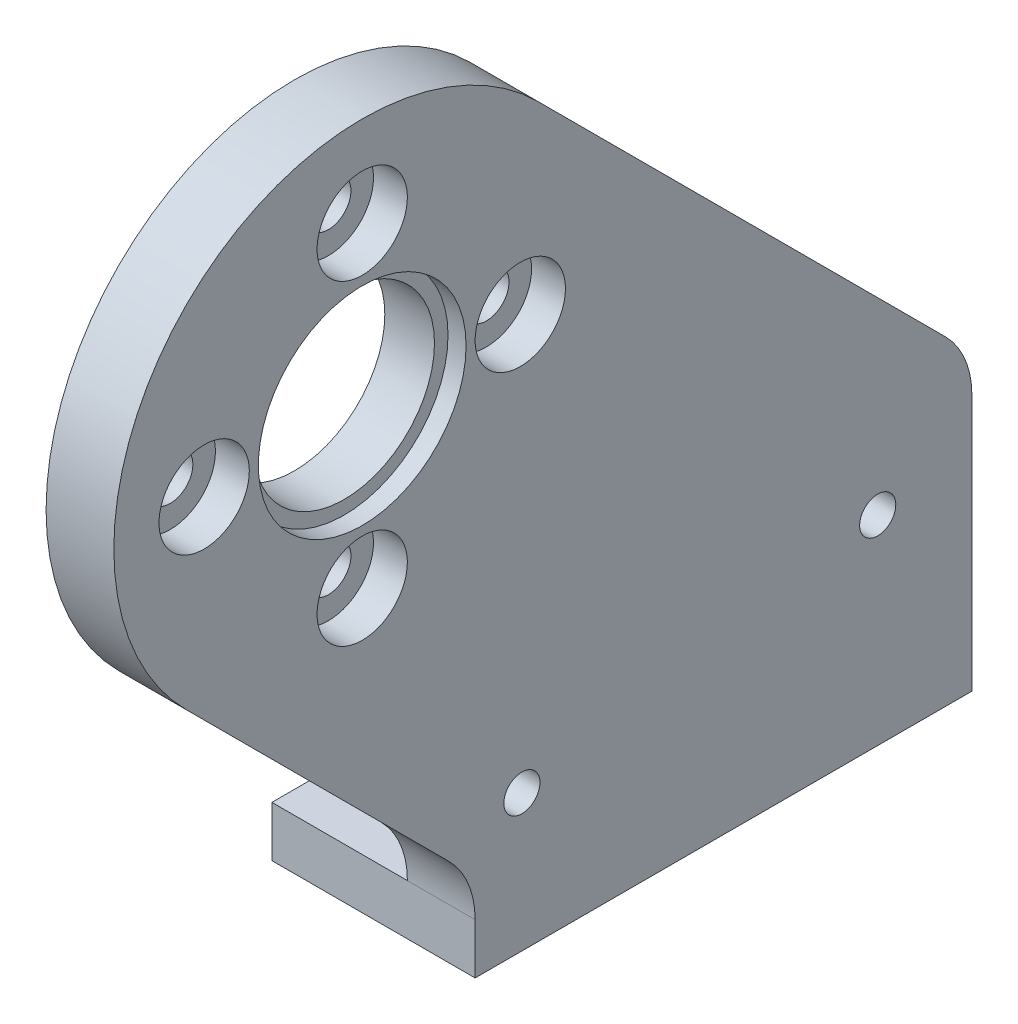
ISO-10303-21;
HEADER;
FILE_DESCRIPTION(('STEP AP214'),'2;1');
FILE_NAME('part.step','',(''),(''),'','','');
FILE_SCHEMA(('AUTOMOTIVE_DESIGN { 1 0 10303 214 1 1 1 1 }'));
ENDSEC;
DATA;
#1=APPLICATION_CONTEXT('core data for automotive mechanical design processes');
#2=APPLICATION_PROTOCOL_DEFINITION('international standard','automotive_design',2000,#1);
#3=PRODUCT_CONTEXT('',#1,'mechanical');
#4=PRODUCT('Part','Part','',(#3));
#5=PRODUCT_RELATED_PRODUCT_CATEGORY('part','',(#4));
#6=PRODUCT_DEFINITION_FORMATION('','',#4);
#7=PRODUCT_DEFINITION_CONTEXT('part definition',#1,'design');
#8=PRODUCT_DEFINITION('design','',#6,#7);
#9=PRODUCT_DEFINITION_SHAPE('','',#8);
#10=(LENGTH_UNIT() NAMED_UNIT(*) SI_UNIT(.MILLI.,.METRE.));
#11=(NAMED_UNIT(*) PLANE_ANGLE_UNIT() SI_UNIT($,.RADIAN.));
#12=(NAMED_UNIT(*) SI_UNIT($,.STERADIAN.) SOLID_ANGLE_UNIT());
#13=UNCERTAINTY_MEASURE_WITH_UNIT(LENGTH_MEASURE(1.E-05),#10,'distance_accuracy_value','');
#14=(GEOMETRIC_REPRESENTATION_CONTEXT(3) GLOBAL_UNCERTAINTY_ASSIGNED_CONTEXT((#13)) GLOBAL_UNIT_ASSIGNED_CONTEXT((#10,
#11,#12)) REPRESENTATION_CONTEXT('',''));
#15=CARTESIAN_POINT('',(0.,0.,0.));
#16=DIRECTION('',(0.,0.,1.));
#17=DIRECTION('',(1.,0.,0.));
#18=AXIS2_PLACEMENT_3D('',#15,#16,#17);
#19=CARTESIAN_POINT('',(69.5,-12.7999999999999,20.9999999999999));
#20=DIRECTION('',(-1.,0.,0.));
#21=DIRECTION('',(0.,0.,1.));
#22=AXIS2_PLACEMENT_3D('',#19,#20,#21);
#23=CYLINDRICAL_SURFACE('',#22,1.);
#24=CARTESIAN_POINT('',(60.,-12.7999999999999,20.9999999999999));
#25=DIRECTION('',(1.,0.,0.));
#26=DIRECTION('',(0.,0.,-1.));
#27=AXIS2_PLACEMENT_3D('',#24,#25,#26);
#28=CIRCLE('',#27,1.);
#29=CARTESIAN_POINT('',(60.,-12.7999999999999,19.9999999999999));
#30=VERTEX_POINT('',#29);
#31=EDGE_CURVE('E43',#30,#30,#28,.F.);
#32=ORIENTED_EDGE('',*,*,#31,.F.);
#33=EDGE_LOOP('',(#32));
#34=FACE_BOUND('',#33,.T.);
#35=CARTESIAN_POINT('',(58.5,-12.7999999999999,20.9999999999999));
#36=DIRECTION('',(-1.,0.,0.));
#37=DIRECTION('',(0.,0.,1.));
#38=AXIS2_PLACEMENT_3D('',#35,#36,#37);
#39=CIRCLE('',#38,1.);
#40=CARTESIAN_POINT('',(58.5,-12.7999999999999,21.9999999999999));
#41=VERTEX_POINT('',#40);
#42=EDGE_CURVE('E270',#41,#41,#39,.T.);
#43=ORIENTED_EDGE('',*,*,#42,.T.);
#44=EDGE_LOOP('',(#43));
#45=FACE_BOUND('',#44,.T.);
#46=ADVANCED_FACE('F39',(#34,#45),#23,.F.);
#47=CARTESIAN_POINT('',(69.5,-5.8,28.));
#48=DIRECTION('',(-1.,0.,0.));
#49=DIRECTION('',(0.,0.,1.));
#50=AXIS2_PLACEMENT_3D('',#47,#48,#49);
#51=CYLINDRICAL_SURFACE('',#50,1.);
#52=CARTESIAN_POINT('',(60.,-5.8,28.));
#53=DIRECTION('',(1.,0.,0.));
#54=DIRECTION('',(0.,0.,-1.));
#55=AXIS2_PLACEMENT_3D('',#52,#53,#54);
#56=CIRCLE('',#55,1.);
#57=CARTESIAN_POINT('',(60.,-5.8,27.));
#58=VERTEX_POINT('',#57);
#59=EDGE_CURVE('E255',#58,#58,#56,.F.);
#60=ORIENTED_EDGE('',*,*,#59,.F.);
#61=EDGE_LOOP('',(#60));
#62=FACE_BOUND('',#61,.T.);
#63=CARTESIAN_POINT('',(58.5,-5.8,28.));
#64=DIRECTION('',(-1.,0.,0.));
#65=DIRECTION('',(0.,0.,1.));
#66=AXIS2_PLACEMENT_3D('',#63,#64,#65);
#67=CIRCLE('',#66,1.);
#68=CARTESIAN_POINT('',(58.5,-5.8,29.));
#69=VERTEX_POINT('',#68);
#70=EDGE_CURVE('E272',#69,#69,#67,.T.);
#71=ORIENTED_EDGE('',*,*,#70,.T.);
#72=EDGE_LOOP('',(#71));
#73=FACE_BOUND('',#72,.T.);
#74=ADVANCED_FACE('F266',(#62,#73),#51,.F.);
#75=CARTESIAN_POINT('',(69.5,1.20000000000005,21.));
#76=DIRECTION('',(-1.,0.,0.));
#77=DIRECTION('',(0.,0.,1.));
#78=AXIS2_PLACEMENT_3D('',#75,#76,#77);
#79=CYLINDRICAL_SURFACE('',#78,1.);
#80=CARTESIAN_POINT('',(60.,1.20000000000005,21.));
#81=DIRECTION('',(1.,0.,0.));
#82=DIRECTION('',(0.,0.,-1.));
#83=AXIS2_PLACEMENT_3D('',#80,#81,#82);
#84=CIRCLE('',#83,1.);
#85=CARTESIAN_POINT('',(60.,1.20000000000005,20.));
#86=VERTEX_POINT('',#85);
#87=EDGE_CURVE('E155',#86,#86,#84,.F.);
#88=ORIENTED_EDGE('',*,*,#87,.F.);
#89=EDGE_LOOP('',(#88));
#90=FACE_BOUND('',#89,.T.);
#91=CARTESIAN_POINT('',(58.5,1.20000000000005,21.));
#92=DIRECTION('',(-1.,0.,0.));
#93=DIRECTION('',(0.,0.,1.));
#94=AXIS2_PLACEMENT_3D('',#91,#92,#93);
#95=CIRCLE('',#94,1.);
#96=CARTESIAN_POINT('',(58.5,1.20000000000005,22.));
#97=VERTEX_POINT('',#96);
#98=EDGE_CURVE('E276',#97,#97,#95,.T.);
#99=ORIENTED_EDGE('',*,*,#98,.T.);
#100=EDGE_LOOP('',(#99));
#101=FACE_BOUND('',#100,.T.);
#102=ADVANCED_FACE('F399',(#90,#101),#79,.F.);
#103=CARTESIAN_POINT('',(69.5,-5.79999999999995,14.));
#104=DIRECTION('',(-1.,0.,0.));
#105=DIRECTION('',(0.,0.,1.));
#106=AXIS2_PLACEMENT_3D('',#103,#104,#105);
#107=CYLINDRICAL_SURFACE('',#106,1.);
#108=CARTESIAN_POINT('',(60.,-5.79999999999995,14.));
#109=DIRECTION('',(1.,0.,0.));
#110=DIRECTION('',(0.,0.,-1.));
#111=AXIS2_PLACEMENT_3D('',#108,#109,#110);
#112=CIRCLE('',#111,1.);
#113=CARTESIAN_POINT('',(60.,-5.79999999999995,13.));
#114=VERTEX_POINT('',#113);
#115=EDGE_CURVE('E173',#114,#114,#112,.F.);
#116=ORIENTED_EDGE('',*,*,#115,.F.);
#117=EDGE_LOOP('',(#116));
#118=FACE_BOUND('',#117,.T.);
#119=CARTESIAN_POINT('',(58.5,-5.79999999999995,14.));
#120=DIRECTION('',(-1.,0.,0.));
#121=DIRECTION('',(0.,0.,1.));
#122=AXIS2_PLACEMENT_3D('',#119,#120,#121);
#123=CIRCLE('',#122,1.);
#124=CARTESIAN_POINT('',(58.5,-5.79999999999995,15.));
#125=VERTEX_POINT('',#124);
#126=EDGE_CURVE('E285',#125,#125,#123,.T.);
#127=ORIENTED_EDGE('',*,*,#126,.T.);
#128=EDGE_LOOP('',(#127));
#129=FACE_BOUND('',#128,.T.);
#130=ADVANCED_FACE('F402',(#118,#129),#107,.F.);
#131=CARTESIAN_POINT('',(60.5,-5.79999999999995,21.));
#132=DIRECTION('',(-1.,0.,0.));
#133=DIRECTION('',(0.,0.,-1.));
#134=AXIS2_PLACEMENT_3D('',#131,#132,#133);
#135=CYLINDRICAL_SURFACE('',#134,4.);
#136=CARTESIAN_POINT('',(60.7,-5.79999999999995,21.));
#137=DIRECTION('',(1.,0.,0.));
#138=DIRECTION('',(0.,0.,-1.));
#139=AXIS2_PLACEMENT_3D('',#136,#137,#138);
#140=CIRCLE('',#139,4.);
#141=CARTESIAN_POINT('',(60.7,-5.79999999999995,17.));
#142=VERTEX_POINT('',#141);
#143=EDGE_CURVE('E180',#142,#142,#140,.F.);
#144=ORIENTED_EDGE('',*,*,#143,.F.);
#145=EDGE_LOOP('',(#144));
#146=FACE_BOUND('',#145,.T.);
#147=CARTESIAN_POINT('',(58.5,-5.79999999999995,21.));
#148=DIRECTION('',(-1.,0.,0.));
#149=DIRECTION('',(0.,0.,1.));
#150=AXIS2_PLACEMENT_3D('',#147,#148,#149);
#151=CIRCLE('',#150,4.);
#152=CARTESIAN_POINT('',(58.5,-5.79999999999995,25.));
#153=VERTEX_POINT('',#152);
#154=EDGE_CURVE('E288',#153,#153,#151,.T.);
#155=ORIENTED_EDGE('',*,*,#154,.T.);
#156=EDGE_LOOP('',(#155));
#157=FACE_BOUND('',#156,.T.);
#158=ADVANCED_FACE('F409',(#146,#157),#135,.F.);
#159=CARTESIAN_POINT('',(61.61096680392,-28.0132034356,20.));
#160=DIRECTION('',(-1.,0.,0.));
#161=DIRECTION('',(0.,-0.707106781186548,0.707106781186548));
#162=AXIS2_PLACEMENT_3D('',#159,#160,#161);
#163=CYLINDRICAL_SURFACE('',#162,4.);
#164=DIRECTION('',(-1.,0.,0.));
#165=VECTOR('',#164,1.);
#166=CARTESIAN_POINT('',(61.5,-25.18477631085,17.171572875254));
#167=LINE('',#166,#165);
#168=CARTESIAN_POINT('',(61.5,-25.18477631085,17.171572875254));
#169=VERTEX_POINT('',#168);
#170=CARTESIAN_POINT('',(58.5,-25.1847763108514,17.1715728752554));
#171=VERTEX_POINT('',#170);
#172=EDGE_CURVE('E118',#169,#171,#167,.T.);
#173=ORIENTED_EDGE('',*,*,#172,.T.);
#174=CARTESIAN_POINT('',(58.5,-28.0132034356,20.));
#175=DIRECTION('',(1.,0.,0.));
#176=DIRECTION('',(0.,0.,1.));
#177=AXIS2_PLACEMENT_3D('',#174,#175,#176);
#178=CIRCLE('',#177,4.00000000000064);
#179=CARTESIAN_POINT('',(58.5,-28.0132034356,16.));
#180=VERTEX_POINT('',#179);
#181=EDGE_CURVE('E121',#180,#171,#178,.T.);
#182=ORIENTED_EDGE('',*,*,#181,.F.);
#183=DIRECTION('',(-1.,0.,0.));
#184=VECTOR('',#183,1.);
#185=CARTESIAN_POINT('',(61.54773426501,-28.0132034356,16.));
#186=LINE('',#185,#184);
#187=CARTESIAN_POINT('',(61.5,-28.0132034356,16.));
#188=VERTEX_POINT('',#187);
#189=EDGE_CURVE('E56',#188,#180,#186,.T.);
#190=ORIENTED_EDGE('',*,*,#189,.F.);
#191=CARTESIAN_POINT('',(61.5,-28.0132034356,20.));
#192=DIRECTION('',(-1.,0.,0.));
#193=DIRECTION('',(0.,0.707106781186548,-0.707106781186548));
#194=AXIS2_PLACEMENT_3D('',#191,#192,#193);
#195=CIRCLE('',#194,4.);
#196=EDGE_CURVE('E11',#169,#188,#195,.T.);
#197=ORIENTED_EDGE('',*,*,#196,.F.);
#198=EDGE_LOOP('',(#173,#182,#190,#197));
#199=FACE_BOUND('',#198,.T.);
#200=ADVANCED_FACE('F120',(#199),#163,.F.);
#201=CARTESIAN_POINT('',(60.93933982822,-28.86066017178,-6.));
#202=DIRECTION('',(0.,0.,-1.));
#203=DIRECTION('',(1.,0.,0.));
#204=AXIS2_PLACEMENT_3D('',#201,#202,#203);
#205=PLANE('',#204);
#206=DIRECTION('',(0.,-1.,2.95824592404915E-13));
#207=VECTOR('',#206,1.);
#208=CARTESIAN_POINT('',(58.5,-18.90050506339,-6.00000000000269));
#209=LINE('',#208,#207);
#210=CARTESIAN_POINT('',(58.5,-18.90050506339,-6.00000000000404));
#211=VERTEX_POINT('',#210);
#212=CARTESIAN_POINT('',(58.5,-28.0132034356,-6.));
#213=VERTEX_POINT('',#212);
#214=EDGE_CURVE('E291',#211,#213,#209,.T.);
#215=ORIENTED_EDGE('',*,*,#214,.F.);
#216=DIRECTION('',(1.,0.,0.));
#217=VECTOR('',#216,1.);
#218=CARTESIAN_POINT('',(59.5,-18.90050506339,-6.));
#219=LINE('',#218,#217);
#220=CARTESIAN_POINT('',(61.5,-18.90050506339,-6.));
#221=VERTEX_POINT('',#220);
#222=EDGE_CURVE('E126',#211,#221,#219,.T.);
#223=ORIENTED_EDGE('',*,*,#222,.T.);
#224=DIRECTION('',(0.,1.,0.));
#225=VECTOR('',#224,1.);
#226=CARTESIAN_POINT('',(61.5,-27.8,-6.));
#227=LINE('',#226,#225);
#228=CARTESIAN_POINT('',(61.5,-30.2494897427832,-6.));
#229=VERTEX_POINT('',#228);
#230=EDGE_CURVE('E48',#229,#221,#227,.T.);
#231=ORIENTED_EDGE('',*,*,#230,.F.);
#232=DIRECTION('',(-1.,0.,0.));
#233=VECTOR('',#232,1.);
#234=CARTESIAN_POINT('',(83.6415947150705,-30.2494897427832,-6.));
#235=LINE('',#234,#233);
#236=CARTESIAN_POINT('',(52.5,-30.2494897427832,-6.));
#237=VERTEX_POINT('',#236);
#238=EDGE_CURVE('E211',#229,#237,#235,.T.);
#239=ORIENTED_EDGE('',*,*,#238,.T.);
#240=DIRECTION('',(0.,-1.,0.));
#241=VECTOR('',#240,1.);
#242=CARTESIAN_POINT('',(52.5,-30.2494897427832,-6.));
#243=LINE('',#242,#241);
#244=CARTESIAN_POINT('',(52.5,-28.0132034356,-6.));
#245=VERTEX_POINT('',#244);
#246=EDGE_CURVE('E199',#245,#237,#243,.T.);
#247=ORIENTED_EDGE('',*,*,#246,.F.);
#248=DIRECTION('',(1.,0.,0.));
#249=VECTOR('',#248,1.);
#250=CARTESIAN_POINT('',(52.5,-28.0132034356,-6.));
#251=LINE('',#250,#249);
#252=EDGE_CURVE('E209',#245,#213,#251,.T.);
#253=ORIENTED_EDGE('',*,*,#252,.T.);
#254=EDGE_LOOP('',(#215,#223,#231,#239,#247,#253));
#255=FACE_BOUND('',#254,.T.);
#256=ADVANCED_FACE('F295',(#255),#205,.T.);
#257=CARTESIAN_POINT('',(60.93933982822,-28.86066017178,16.));
#258=DIRECTION('',(0.,0.,1.));
#259=DIRECTION('',(0.,1.,0.));
#260=AXIS2_PLACEMENT_3D('',#257,#258,#259);
#261=PLANE('',#260);
#262=ORIENTED_EDGE('',*,*,#189,.T.);
#263=DIRECTION('',(1.,0.,0.));
#264=VECTOR('',#263,1.);
#265=CARTESIAN_POINT('',(52.5,-28.0132034356,16.));
#266=LINE('',#265,#264);
#267=CARTESIAN_POINT('',(52.5,-28.0132034356,16.));
#268=VERTEX_POINT('',#267);
#269=EDGE_CURVE('E207',#268,#180,#266,.T.);
#270=ORIENTED_EDGE('',*,*,#269,.F.);
#271=DIRECTION('',(0.,1.,0.));
#272=VECTOR('',#271,1.);
#273=CARTESIAN_POINT('',(52.5,-28.0132034356,16.));
#274=LINE('',#273,#272);
#275=CARTESIAN_POINT('',(52.5,-30.2494897427832,16.));
#276=VERTEX_POINT('',#275);
#277=EDGE_CURVE('E205',#276,#268,#274,.T.);
#278=ORIENTED_EDGE('',*,*,#277,.F.);
#279=DIRECTION('',(-1.,0.,0.));
#280=VECTOR('',#279,1.);
#281=CARTESIAN_POINT('',(83.6415947150705,-30.2494897427832,16.));
#282=LINE('',#281,#280);
#283=CARTESIAN_POINT('',(61.5,-30.2494897427832,16.));
#284=VERTEX_POINT('',#283);
#285=EDGE_CURVE('E212',#284,#276,#282,.T.);
#286=ORIENTED_EDGE('',*,*,#285,.F.);
#287=DIRECTION('',(0.,1.,0.));
#288=VECTOR('',#287,1.);
#289=CARTESIAN_POINT('',(61.5,-28.86066017178,16.));
#290=LINE('',#289,#288);
#291=EDGE_CURVE('E214',#284,#188,#290,.T.);
#292=ORIENTED_EDGE('',*,*,#291,.T.);
#293=EDGE_LOOP('',(#262,#270,#278,#286,#292));
#294=FACE_BOUND('',#293,.T.);
#295=ADVANCED_FACE('F303',(#294),#261,.T.);
#296=CARTESIAN_POINT('',(61.5,-27.8,32.));
#297=DIRECTION('',(1.,0.,0.));
#298=DIRECTION('',(0.,-1.,0.));
#299=AXIS2_PLACEMENT_3D('',#296,#297,#298);
#300=PLANE('',#299);
#301=CARTESIAN_POINT('',(61.5,-12.7999999999999,20.9999999999999));
#302=DIRECTION('',(1.,0.,0.));
#303=DIRECTION('',(0.,0.,-1.));
#304=AXIS2_PLACEMENT_3D('',#301,#302,#303);
#305=CIRCLE('',#304,2.);
#306=CARTESIAN_POINT('',(61.5,-12.7999999999999,18.9999999999999));
#307=VERTEX_POINT('',#306);
#308=EDGE_CURVE('E156',#307,#307,#305,.T.);
#309=ORIENTED_EDGE('',*,*,#308,.F.);
#310=EDGE_LOOP('',(#309));
#311=FACE_BOUND('',#310,.T.);
#312=CARTESIAN_POINT('',(61.5,-5.8,28.));
#313=DIRECTION('',(1.,0.,0.));
#314=DIRECTION('',(0.,0.,-1.));
#315=AXIS2_PLACEMENT_3D('',#312,#313,#314);
#316=CIRCLE('',#315,2.);
#317=CARTESIAN_POINT('',(61.5,-5.8,26.));
#318=VERTEX_POINT('',#317);
#319=EDGE_CURVE('E162',#318,#318,#316,.T.);
#320=ORIENTED_EDGE('',*,*,#319,.F.);
#321=EDGE_LOOP('',(#320));
#322=FACE_BOUND('',#321,.T.);
#323=CARTESIAN_POINT('',(61.5,1.20000000000005,21.));
#324=DIRECTION('',(1.,0.,0.));
#325=DIRECTION('',(0.,0.,-1.));
#326=AXIS2_PLACEMENT_3D('',#323,#324,#325);
#327=CIRCLE('',#326,2.);
#328=CARTESIAN_POINT('',(61.5,1.20000000000005,19.));
#329=VERTEX_POINT('',#328);
#330=EDGE_CURVE('E151',#329,#329,#327,.T.);
#331=ORIENTED_EDGE('',*,*,#330,.F.);
#332=EDGE_LOOP('',(#331));
#333=FACE_BOUND('',#332,.T.);
#334=CARTESIAN_POINT('',(61.5,-5.79999999999995,14.));
#335=DIRECTION('',(1.,0.,0.));
#336=DIRECTION('',(0.,0.,-1.));
#337=AXIS2_PLACEMENT_3D('',#334,#335,#336);
#338=CIRCLE('',#337,2.);
#339=CARTESIAN_POINT('',(61.5,-5.79999999999995,12.));
#340=VERTEX_POINT('',#339);
#341=EDGE_CURVE('E174',#340,#340,#338,.T.);
#342=ORIENTED_EDGE('',*,*,#341,.F.);
#343=EDGE_LOOP('',(#342));
#344=FACE_BOUND('',#343,.T.);
#345=CARTESIAN_POINT('',(61.5,-5.80000000000003,21.0000000000001));
#346=DIRECTION('',(1.,0.,0.));
#347=DIRECTION('',(0.,0.,-1.));
#348=AXIS2_PLACEMENT_3D('',#345,#346,#347);
#349=CIRCLE('',#348,4.6);
#350=CARTESIAN_POINT('',(61.5,-5.80000000000003,16.4000000000001));
#351=VERTEX_POINT('',#350);
#352=EDGE_CURVE('E181',#351,#351,#349,.T.);
#353=ORIENTED_EDGE('',*,*,#352,.F.);
#354=EDGE_LOOP('',(#353));
#355=FACE_BOUND('',#354,.T.);
#356=ORIENTED_EDGE('',*,*,#196,.T.);
#357=ORIENTED_EDGE('',*,*,#291,.F.);
#358=DIRECTION('',(0.,0.,1.));
#359=VECTOR('',#358,1.);
#360=CARTESIAN_POINT('',(61.5,-30.2494897427832,32.));
#361=LINE('',#360,#359);
#362=EDGE_CURVE('E217',#229,#284,#361,.T.);
#363=ORIENTED_EDGE('',*,*,#362,.F.);
#364=ORIENTED_EDGE('',*,*,#230,.T.);
#365=CARTESIAN_POINT('',(61.5,-18.90050506339,-2.));
#366=DIRECTION('',(1.,0.,0.));
#367=DIRECTION('',(0.,0.,-1.));
#368=AXIS2_PLACEMENT_3D('',#365,#366,#367);
#369=CIRCLE('',#368,4.);
#370=CARTESIAN_POINT('',(61.5,-16.07207793864,-4.82842712475));
#371=VERTEX_POINT('',#370);
#372=EDGE_CURVE('E229',#221,#371,#369,.T.);
#373=ORIENTED_EDGE('',*,*,#372,.T.);
#374=DIRECTION('',(0.,-0.707106781186548,-0.707106781186548));
#375=VECTOR('',#374,1.);
#376=CARTESIAN_POINT('',(61.5,1.97817459305205,13.221825406948));
#377=LINE('',#376,#375);
#378=CARTESIAN_POINT('',(61.5,1.97817459305205,13.221825406948));
#379=VERTEX_POINT('',#378);
#380=EDGE_CURVE('E221',#379,#371,#377,.T.);
#381=ORIENTED_EDGE('',*,*,#380,.F.);
#382=CARTESIAN_POINT('',(61.5,-5.79999999999998,21.));
#383=DIRECTION('',(-1.,0.,0.));
#384=DIRECTION('',(0.,0.745298433795883,-0.666731013663985));
#385=AXIS2_PLACEMENT_3D('',#382,#383,#384);
#386=CIRCLE('',#385,11.);
#387=CARTESIAN_POINT('',(61.5,-13.578174593052,28.778174593052));
#388=VERTEX_POINT('',#387);
#389=EDGE_CURVE('E224',#388,#379,#386,.T.);
#390=ORIENTED_EDGE('',*,*,#389,.F.);
#391=DIRECTION('',(0.,0.707106781186548,0.707106781186548));
#392=VECTOR('',#391,1.);
#393=CARTESIAN_POINT('',(61.5,-25.18477631085,17.171572875254));
#394=LINE('',#393,#392);
#395=EDGE_CURVE('E125',#169,#388,#394,.T.);
#396=ORIENTED_EDGE('',*,*,#395,.F.);
#397=EDGE_LOOP('',(#356,#357,#363,#364,#373,#381,#390,#396));
#398=FACE_BOUND('',#397,.T.);
#399=CARTESIAN_POINT('',(61.5,-24.18477631085,13.928932188135));
#400=DIRECTION('',(-1.,0.,0.));
#401=DIRECTION('',(0.,-1.,0.));
#402=AXIS2_PLACEMENT_3D('',#399,#400,#401);
#403=CIRCLE('',#402,0.8);
#404=CARTESIAN_POINT('',(61.5,-24.98477631085,13.928932188135));
#405=VERTEX_POINT('',#404);
#406=EDGE_CURVE('E232',#405,#405,#403,.T.);
#407=ORIENTED_EDGE('',*,*,#406,.T.);
#408=EDGE_LOOP('',(#407));
#409=FACE_BOUND('',#408,.T.);
#410=CARTESIAN_POINT('',(61.5,-21.40640546818,-1.82799186006));
#411=DIRECTION('',(-1.,0.,0.));
#412=DIRECTION('',(0.,-1.,0.));
#413=AXIS2_PLACEMENT_3D('',#410,#411,#412);
#414=CIRCLE('',#413,0.8);
#415=CARTESIAN_POINT('',(61.5,-22.20640546818,-1.82799186006));
#416=VERTEX_POINT('',#415);
#417=EDGE_CURVE('E235',#416,#416,#414,.T.);
#418=ORIENTED_EDGE('',*,*,#417,.T.);
#419=EDGE_LOOP('',(#418));
#420=FACE_BOUND('',#419,.T.);
#421=ADVANCED_FACE('F305',(#311,#322,#333,#344,#355,#398,#409,#420),#300,.T.);
#422=CARTESIAN_POINT('',(59.40518465266,-18.90050506339,-2.));
#423=DIRECTION('',(1.,0.,0.));
#424=DIRECTION('',(0.,0.,1.));
#425=AXIS2_PLACEMENT_3D('',#422,#423,#424);
#426=CYLINDRICAL_SURFACE('',#425,4.);
#427=ORIENTED_EDGE('',*,*,#222,.F.);
#428=CARTESIAN_POINT('',(58.5,-18.90050506339,-2.));
#429=DIRECTION('',(-1.,0.,0.));
#430=DIRECTION('',(0.,0.,1.));
#431=AXIS2_PLACEMENT_3D('',#428,#429,#430);
#432=CIRCLE('',#431,4.00000000000404);
#433=CARTESIAN_POINT('',(58.5,-16.07207793864,-4.82842712475));
#434=VERTEX_POINT('',#433);
#435=EDGE_CURVE('E148',#434,#211,#432,.T.);
#436=ORIENTED_EDGE('',*,*,#435,.F.);
#437=DIRECTION('',(1.,0.,0.));
#438=VECTOR('',#437,1.);
#439=CARTESIAN_POINT('',(59.5,-16.07207793864,-4.82842712475));
#440=LINE('',#439,#438);
#441=EDGE_CURVE('E223',#434,#371,#440,.T.);
#442=ORIENTED_EDGE('',*,*,#441,.T.);
#443=ORIENTED_EDGE('',*,*,#372,.F.);
#444=EDGE_LOOP('',(#427,#436,#442,#443));
#445=FACE_BOUND('',#444,.T.);
#446=ADVANCED_FACE('F312',(#445),#426,.T.);
#447=CARTESIAN_POINT('',(60.5,-7.63273811042195,3.61091270347));
#448=DIRECTION('',(0.,-0.707106781186548,0.707106781186548));
#449=DIRECTION('',(0.,0.707106781186548,0.707106781186548));
#450=AXIS2_PLACEMENT_3D('',#447,#448,#449);
#451=PLANE('',#450);
#452=ORIENTED_EDGE('',*,*,#441,.F.);
#453=DIRECTION('',(0.,-0.707106781186431,-0.707106781186664));
#454=VECTOR('',#453,1.);
#455=CARTESIAN_POINT('',(58.5,1.97817459305204,13.221825406948));
#456=LINE('',#455,#454);
#457=CARTESIAN_POINT('',(58.5,1.97817459305204,13.221825406948));
#458=VERTEX_POINT('',#457);
#459=EDGE_CURVE('E142',#458,#434,#456,.T.);
#460=ORIENTED_EDGE('',*,*,#459,.F.);
#461=DIRECTION('',(-1.,0.,0.));
#462=VECTOR('',#461,1.);
#463=CARTESIAN_POINT('',(61.5,1.97817459305205,13.221825406948));
#464=LINE('',#463,#462);
#465=EDGE_CURVE('E226',#379,#458,#464,.T.);
#466=ORIENTED_EDGE('',*,*,#465,.F.);
#467=ORIENTED_EDGE('',*,*,#380,.T.);
#468=EDGE_LOOP('',(#452,#460,#466,#467));
#469=FACE_BOUND('',#468,.T.);
#470=ADVANCED_FACE('F436',(#469),#451,.F.);
#471=CARTESIAN_POINT('',(60.5,-5.79999999999998,21.));
#472=DIRECTION('',(-1.,0.,0.));
#473=DIRECTION('',(0.,0.,-1.));
#474=AXIS2_PLACEMENT_3D('',#471,#472,#473);
#475=CYLINDRICAL_SURFACE('',#474,11.);
#476=ORIENTED_EDGE('',*,*,#389,.T.);
#477=ORIENTED_EDGE('',*,*,#465,.T.);
#478=CARTESIAN_POINT('',(58.5,-5.79999999999998,21.));
#479=DIRECTION('',(-1.,0.,0.));
#480=DIRECTION('',(0.,0.,1.));
#481=AXIS2_PLACEMENT_3D('',#478,#479,#480);
#482=CIRCLE('',#481,11.);
#483=CARTESIAN_POINT('',(58.5,-13.578174593052,28.778174593052));
#484=VERTEX_POINT('',#483);
#485=EDGE_CURVE('E140',#484,#458,#482,.T.);
#486=ORIENTED_EDGE('',*,*,#485,.F.);
#487=DIRECTION('',(-1.,0.,0.));
#488=VECTOR('',#487,1.);
#489=CARTESIAN_POINT('',(61.5,-13.578174593052,28.778174593052));
#490=LINE('',#489,#488);
#491=EDGE_CURVE('E139',#388,#484,#490,.T.);
#492=ORIENTED_EDGE('',*,*,#491,.F.);
#493=EDGE_LOOP('',(#476,#477,#486,#492));
#494=FACE_BOUND('',#493,.T.);
#495=ADVANCED_FACE('F440',(#494),#475,.T.);
#496=CARTESIAN_POINT('',(60.5,-19.96726188958,22.389087296526));
#497=DIRECTION('',(0.,0.707106781186548,-0.707106781186548));
#498=DIRECTION('',(0.,-0.707106781186548,-0.707106781186548));
#499=AXIS2_PLACEMENT_3D('',#496,#497,#498);
#500=PLANE('',#499);
#501=ORIENTED_EDGE('',*,*,#491,.T.);
#502=DIRECTION('',(0.,0.707106781186603,0.707106781186492));
#503=VECTOR('',#502,1.);
#504=CARTESIAN_POINT('',(58.5,-25.1847763108509,17.1715728752549));
#505=LINE('',#504,#503);
#506=EDGE_CURVE('E134',#171,#484,#505,.T.);
#507=ORIENTED_EDGE('',*,*,#506,.F.);
#508=ORIENTED_EDGE('',*,*,#172,.F.);
#509=ORIENTED_EDGE('',*,*,#395,.T.);
#510=EDGE_LOOP('',(#501,#507,#508,#509));
#511=FACE_BOUND('',#510,.T.);
#512=ADVANCED_FACE('F137',(#511),#500,.F.);
#513=CARTESIAN_POINT('',(59.65,-24.18477631085,13.928932188135));
#514=DIRECTION('',(-1.,0.,0.));
#515=DIRECTION('',(0.,-1.,0.));
#516=AXIS2_PLACEMENT_3D('',#513,#514,#515);
#517=CONICAL_SURFACE('',#516,0.95,0.7853981625);
#518=CARTESIAN_POINT('',(59.5,-24.18477631085,13.928932188135));
#519=DIRECTION('',(-1.,0.,0.));
#520=DIRECTION('',(0.,0.,1.));
#521=AXIS2_PLACEMENT_3D('',#518,#519,#520);
#522=CIRCLE('',#521,1.1);
#523=CARTESIAN_POINT('',(59.5,-24.18477631085,15.028932188135));
#524=VERTEX_POINT('',#523);
#525=EDGE_CURVE('E279',#524,#524,#522,.T.);
#526=ORIENTED_EDGE('',*,*,#525,.T.);
#527=EDGE_LOOP('',(#526));
#528=FACE_BOUND('',#527,.T.);
#529=CARTESIAN_POINT('',(59.8,-24.18477631085,13.928932188135));
#530=DIRECTION('',(-1.,0.,0.));
#531=DIRECTION('',(0.,1.,0.));
#532=AXIS2_PLACEMENT_3D('',#529,#530,#531);
#533=CIRCLE('',#532,0.8);
#534=CARTESIAN_POINT('',(59.8,-23.38477631085,13.928932188135));
#535=VERTEX_POINT('',#534);
#536=EDGE_CURVE('E245',#535,#535,#533,.T.);
#537=ORIENTED_EDGE('',*,*,#536,.F.);
#538=EDGE_LOOP('',(#537));
#539=FACE_BOUND('',#538,.T.);
#540=ADVANCED_FACE('F319',(#528,#539),#517,.F.);
#541=CARTESIAN_POINT('',(62.10472291998,-24.18477631085,13.928932188135));
#542=DIRECTION('',(-1.,0.,0.));
#543=DIRECTION('',(0.,-1.,0.));
#544=AXIS2_PLACEMENT_3D('',#541,#542,#543);
#545=CYLINDRICAL_SURFACE('',#544,0.8);
#546=ORIENTED_EDGE('',*,*,#536,.T.);
#547=EDGE_LOOP('',(#546));
#548=FACE_BOUND('',#547,.T.);
#549=ORIENTED_EDGE('',*,*,#406,.F.);
#550=EDGE_LOOP('',(#549));
#551=FACE_BOUND('',#550,.T.);
#552=ADVANCED_FACE('F322',(#548,#551),#545,.F.);
#553=CARTESIAN_POINT('',(59.65,-21.40640546818,-1.82799186006));
#554=DIRECTION('',(-1.,0.,0.));
#555=DIRECTION('',(0.,-1.,0.));
#556=AXIS2_PLACEMENT_3D('',#553,#554,#555);
#557=CONICAL_SURFACE('',#556,0.95,0.7853981625);
#558=CARTESIAN_POINT('',(59.5,-21.40640546818,-1.82799186006));
#559=DIRECTION('',(-1.,0.,0.));
#560=DIRECTION('',(0.,0.,1.));
#561=AXIS2_PLACEMENT_3D('',#558,#559,#560);
#562=CIRCLE('',#561,1.1);
#563=CARTESIAN_POINT('',(59.5,-21.40640546818,-0.72799186006));
#564=VERTEX_POINT('',#563);
#565=EDGE_CURVE('E338',#564,#564,#562,.T.);
#566=ORIENTED_EDGE('',*,*,#565,.T.);
#567=EDGE_LOOP('',(#566));
#568=FACE_BOUND('',#567,.T.);
#569=CARTESIAN_POINT('',(59.8,-21.40640546818,-1.82799186006));
#570=DIRECTION('',(-1.,0.,0.));
#571=DIRECTION('',(0.,1.,0.));
#572=AXIS2_PLACEMENT_3D('',#569,#570,#571);
#573=CIRCLE('',#572,0.8);
#574=CARTESIAN_POINT('',(59.8,-20.60640546818,-1.82799186006));
#575=VERTEX_POINT('',#574);
#576=EDGE_CURVE('E220',#575,#575,#573,.T.);
#577=ORIENTED_EDGE('',*,*,#576,.F.);
#578=EDGE_LOOP('',(#577));
#579=FACE_BOUND('',#578,.T.);
#580=ADVANCED_FACE('F325',(#568,#579),#557,.F.);
#581=CARTESIAN_POINT('',(62.10472291998,-21.40640546818,-1.82799186006));
#582=DIRECTION('',(-1.,0.,0.));
#583=DIRECTION('',(0.,-1.,0.));
#584=AXIS2_PLACEMENT_3D('',#581,#582,#583);
#585=CYLINDRICAL_SURFACE('',#584,0.8);
#586=ORIENTED_EDGE('',*,*,#576,.T.);
#587=EDGE_LOOP('',(#586));
#588=FACE_BOUND('',#587,.T.);
#589=ORIENTED_EDGE('',*,*,#417,.F.);
#590=EDGE_LOOP('',(#589));
#591=FACE_BOUND('',#590,.T.);
#592=ADVANCED_FACE('F41',(#588,#591),#585,.F.);
#593=CARTESIAN_POINT('',(83.6415947150705,-30.2494897427832,-6.));
#594=DIRECTION('',(0.,-1.,0.));
#595=DIRECTION('',(0.,0.,-1.));
#596=AXIS2_PLACEMENT_3D('',#593,#594,#595);
#597=PLANE('',#596);
#598=CARTESIAN_POINT('',(55.5,-30.2494897427832,13.));
#599=DIRECTION('',(0.,-1.,0.));
#600=DIRECTION('',(0.,0.,-1.));
#601=AXIS2_PLACEMENT_3D('',#598,#599,#600);
#602=CIRCLE('',#601,0.999999999999998);
#603=CARTESIAN_POINT('',(55.5,-30.2494897427832,12.));
#604=VERTEX_POINT('',#603);
#605=EDGE_CURVE('E187',#604,#604,#602,.T.);
#606=ORIENTED_EDGE('',*,*,#605,.F.);
#607=EDGE_LOOP('',(#606));
#608=FACE_BOUND('',#607,.T.);
#609=CARTESIAN_POINT('',(55.5,-30.2494897427832,-3.04196010845019));
#610=DIRECTION('',(0.,-1.,0.));
#611=DIRECTION('',(0.,0.,-1.));
#612=AXIS2_PLACEMENT_3D('',#609,#610,#611);
#613=CIRCLE('',#612,0.999999999999998);
#614=CARTESIAN_POINT('',(55.5,-30.2494897427832,-4.04196010845019));
#615=VERTEX_POINT('',#614);
#616=EDGE_CURVE('E193',#615,#615,#613,.T.);
#617=ORIENTED_EDGE('',*,*,#616,.F.);
#618=EDGE_LOOP('',(#617));
#619=FACE_BOUND('',#618,.T.);
#620=ORIENTED_EDGE('',*,*,#238,.F.);
#621=ORIENTED_EDGE('',*,*,#362,.T.);
#622=ORIENTED_EDGE('',*,*,#285,.T.);
#623=DIRECTION('',(0.,0.,1.));
#624=VECTOR('',#623,1.);
#625=CARTESIAN_POINT('',(52.5,-30.2494897427832,16.));
#626=LINE('',#625,#624);
#627=EDGE_CURVE('E202',#237,#276,#626,.T.);
#628=ORIENTED_EDGE('',*,*,#627,.F.);
#629=EDGE_LOOP('',(#620,#621,#622,#628));
#630=FACE_BOUND('',#629,.T.);
#631=ADVANCED_FACE('F333',(#608,#619,#630),#597,.T.);
#632=CARTESIAN_POINT('',(52.5,-28.0132034356,-6.));
#633=DIRECTION('',(0.,-1.,0.));
#634=DIRECTION('',(0.,0.,-1.));
#635=AXIS2_PLACEMENT_3D('',#632,#633,#634);
#636=PLANE('',#635);
#637=CARTESIAN_POINT('',(55.5,-28.0132034356,13.));
#638=DIRECTION('',(0.,1.,0.));
#639=DIRECTION('',(0.,0.,1.));
#640=AXIS2_PLACEMENT_3D('',#637,#638,#639);
#641=CIRCLE('',#640,0.999999999999998);
#642=CARTESIAN_POINT('',(55.5,-28.0132034356,14.));
#643=VERTEX_POINT('',#642);
#644=EDGE_CURVE('E184',#643,#643,#641,.T.);
#645=ORIENTED_EDGE('',*,*,#644,.F.);
#646=EDGE_LOOP('',(#645));
#647=FACE_BOUND('',#646,.T.);
#648=CARTESIAN_POINT('',(55.5,-28.0132034356,-3.04196010845019));
#649=DIRECTION('',(0.,1.,0.));
#650=DIRECTION('',(0.,0.,1.));
#651=AXIS2_PLACEMENT_3D('',#648,#649,#650);
#652=CIRCLE('',#651,0.999999999999998);
#653=CARTESIAN_POINT('',(55.5,-28.0132034356,-2.04196010845019));
#654=VERTEX_POINT('',#653);
#655=EDGE_CURVE('E190',#654,#654,#652,.T.);
#656=ORIENTED_EDGE('',*,*,#655,.F.);
#657=EDGE_LOOP('',(#656));
#658=FACE_BOUND('',#657,.T.);
#659=ORIENTED_EDGE('',*,*,#269,.T.);
#660=DIRECTION('',(0.,0.,1.));
#661=VECTOR('',#660,1.);
#662=CARTESIAN_POINT('',(58.5,-28.0132034356,-6.));
#663=LINE('',#662,#661);
#664=EDGE_CURVE('E63',#213,#180,#663,.T.);
#665=ORIENTED_EDGE('',*,*,#664,.F.);
#666=ORIENTED_EDGE('',*,*,#252,.F.);
#667=DIRECTION('',(0.,0.,-1.));
#668=VECTOR('',#667,1.);
#669=CARTESIAN_POINT('',(52.5,-28.0132034356,-6.));
#670=LINE('',#669,#668);
#671=EDGE_CURVE('E196',#268,#245,#670,.T.);
#672=ORIENTED_EDGE('',*,*,#671,.F.);
#673=EDGE_LOOP('',(#659,#665,#666,#672));
#674=FACE_BOUND('',#673,.T.);
#675=ADVANCED_FACE('F297',(#647,#658,#674),#636,.F.);
#676=CARTESIAN_POINT('',(52.5,0.,0.));
#677=DIRECTION('',(1.,0.,0.));
#678=DIRECTION('',(0.,0.,-1.));
#679=AXIS2_PLACEMENT_3D('',#676,#677,#678);
#680=PLANE('',#679);
#681=ORIENTED_EDGE('',*,*,#671,.T.);
#682=ORIENTED_EDGE('',*,*,#246,.T.);
#683=ORIENTED_EDGE('',*,*,#627,.T.);
#684=ORIENTED_EDGE('',*,*,#277,.T.);
#685=EDGE_LOOP('',(#681,#682,#683,#684));
#686=FACE_BOUND('',#685,.T.);
#687=ADVANCED_FACE('F299',(#686),#680,.F.);
#688=CARTESIAN_POINT('',(55.5,-34.0132034356,-3.04196010845019));
#689=DIRECTION('',(0.,1.,0.));
#690=DIRECTION('',(0.,0.,1.));
#691=AXIS2_PLACEMENT_3D('',#688,#689,#690);
#692=CYLINDRICAL_SURFACE('',#691,0.999999999999998);
#693=ORIENTED_EDGE('',*,*,#616,.T.);
#694=EDGE_LOOP('',(#693));
#695=FACE_BOUND('',#694,.T.);
#696=ORIENTED_EDGE('',*,*,#655,.T.);
#697=EDGE_LOOP('',(#696));
#698=FACE_BOUND('',#697,.T.);
#699=ADVANCED_FACE('F421',(#695,#698),#692,.F.);
#700=CARTESIAN_POINT('',(55.5,-34.0132034356,13.));
#701=DIRECTION('',(0.,1.,0.));
#702=DIRECTION('',(0.,0.,1.));
#703=AXIS2_PLACEMENT_3D('',#700,#701,#702);
#704=CYLINDRICAL_SURFACE('',#703,0.999999999999998);
#705=ORIENTED_EDGE('',*,*,#605,.T.);
#706=EDGE_LOOP('',(#705));
#707=FACE_BOUND('',#706,.T.);
#708=ORIENTED_EDGE('',*,*,#644,.T.);
#709=EDGE_LOOP('',(#708));
#710=FACE_BOUND('',#709,.T.);
#711=ADVANCED_FACE('F414',(#707,#710),#704,.F.);
#712=CARTESIAN_POINT('',(60.7,-5.80000000000003,21.0000000000001));
#713=DIRECTION('',(1.,0.,0.));
#714=DIRECTION('',(0.,0.,-1.));
#715=AXIS2_PLACEMENT_3D('',#712,#713,#714);
#716=PLANE('',#715);
#717=CARTESIAN_POINT('',(60.7,-5.80000000000003,21.0000000000001));
#718=DIRECTION('',(1.,0.,0.));
#719=DIRECTION('',(0.,0.,-1.));
#720=AXIS2_PLACEMENT_3D('',#717,#718,#719);
#721=CIRCLE('',#720,4.6);
#722=CARTESIAN_POINT('',(60.7,-5.80000000000003,16.4000000000001));
#723=VERTEX_POINT('',#722);
#724=EDGE_CURVE('E177',#723,#723,#721,.T.);
#725=ORIENTED_EDGE('',*,*,#724,.T.);
#726=EDGE_LOOP('',(#725));
#727=FACE_BOUND('',#726,.T.);
#728=ORIENTED_EDGE('',*,*,#143,.T.);
#729=EDGE_LOOP('',(#728));
#730=FACE_BOUND('',#729,.T.);
#731=ADVANCED_FACE('F411',(#727,#730),#716,.T.);
#732=CARTESIAN_POINT('',(60.7,-5.80000000000003,21.0000000000001));
#733=DIRECTION('',(1.,0.,0.));
#734=DIRECTION('',(0.,0.,-1.));
#735=AXIS2_PLACEMENT_3D('',#732,#733,#734);
#736=CYLINDRICAL_SURFACE('',#735,4.6);
#737=ORIENTED_EDGE('',*,*,#724,.F.);
#738=EDGE_LOOP('',(#737));
#739=FACE_BOUND('',#738,.T.);
#740=ORIENTED_EDGE('',*,*,#352,.T.);
#741=EDGE_LOOP('',(#740));
#742=FACE_BOUND('',#741,.T.);
#743=ADVANCED_FACE('F394',(#739,#742),#736,.F.);
#744=CARTESIAN_POINT('',(60.,-5.79999999999995,14.));
#745=DIRECTION('',(1.,0.,0.));
#746=DIRECTION('',(0.,0.,-1.));
#747=AXIS2_PLACEMENT_3D('',#744,#745,#746);
#748=PLANE('',#747);
#749=CARTESIAN_POINT('',(60.,-5.79999999999995,14.));
#750=DIRECTION('',(1.,0.,0.));
#751=DIRECTION('',(0.,0.,-1.));
#752=AXIS2_PLACEMENT_3D('',#749,#750,#751);
#753=CIRCLE('',#752,2.);
#754=CARTESIAN_POINT('',(60.,-5.79999999999995,12.));
#755=VERTEX_POINT('',#754);
#756=EDGE_CURVE('E170',#755,#755,#753,.T.);
#757=ORIENTED_EDGE('',*,*,#756,.T.);
#758=EDGE_LOOP('',(#757));
#759=FACE_BOUND('',#758,.T.);
#760=ORIENTED_EDGE('',*,*,#115,.T.);
#761=EDGE_LOOP('',(#760));
#762=FACE_BOUND('',#761,.T.);
#763=ADVANCED_FACE('F391',(#759,#762),#748,.T.);
#764=CARTESIAN_POINT('',(60.,-5.79999999999995,14.));
#765=DIRECTION('',(1.,0.,0.));
#766=DIRECTION('',(0.,0.,-1.));
#767=AXIS2_PLACEMENT_3D('',#764,#765,#766);
#768=CYLINDRICAL_SURFACE('',#767,2.);
#769=ORIENTED_EDGE('',*,*,#756,.F.);
#770=EDGE_LOOP('',(#769));
#771=FACE_BOUND('',#770,.T.);
#772=ORIENTED_EDGE('',*,*,#341,.T.);
#773=EDGE_LOOP('',(#772));
#774=FACE_BOUND('',#773,.T.);
#775=ADVANCED_FACE('F386',(#771,#774),#768,.F.);
#776=CARTESIAN_POINT('',(60.,1.20000000000005,21.));
#777=DIRECTION('',(1.,0.,0.));
#778=DIRECTION('',(0.,0.,-1.));
#779=AXIS2_PLACEMENT_3D('',#776,#777,#778);
#780=PLANE('',#779);
#781=CARTESIAN_POINT('',(60.,1.20000000000005,21.));
#782=DIRECTION('',(1.,0.,0.));
#783=DIRECTION('',(0.,0.,-1.));
#784=AXIS2_PLACEMENT_3D('',#781,#782,#783);
#785=CIRCLE('',#784,2.);
#786=CARTESIAN_POINT('',(60.,1.20000000000005,19.));
#787=VERTEX_POINT('',#786);
#788=EDGE_CURVE('E165',#787,#787,#785,.T.);
#789=ORIENTED_EDGE('',*,*,#788,.T.);
#790=EDGE_LOOP('',(#789));
#791=FACE_BOUND('',#790,.T.);
#792=ORIENTED_EDGE('',*,*,#87,.T.);
#793=EDGE_LOOP('',(#792));
#794=FACE_BOUND('',#793,.T.);
#795=ADVANCED_FACE('F383',(#791,#794),#780,.T.);
#796=CARTESIAN_POINT('',(60.,1.20000000000005,21.));
#797=DIRECTION('',(1.,0.,0.));
#798=DIRECTION('',(0.,0.,-1.));
#799=AXIS2_PLACEMENT_3D('',#796,#797,#798);
#800=CYLINDRICAL_SURFACE('',#799,2.);
#801=ORIENTED_EDGE('',*,*,#788,.F.);
#802=EDGE_LOOP('',(#801));
#803=FACE_BOUND('',#802,.T.);
#804=ORIENTED_EDGE('',*,*,#330,.T.);
#805=EDGE_LOOP('',(#804));
#806=FACE_BOUND('',#805,.T.);
#807=ADVANCED_FACE('F378',(#803,#806),#800,.F.);
#808=CARTESIAN_POINT('',(60.,-5.8,28.));
#809=DIRECTION('',(1.,0.,0.));
#810=DIRECTION('',(0.,0.,-1.));
#811=AXIS2_PLACEMENT_3D('',#808,#809,#810);
#812=PLANE('',#811);
#813=CARTESIAN_POINT('',(60.,-5.8,28.));
#814=DIRECTION('',(1.,0.,0.));
#815=DIRECTION('',(0.,0.,-1.));
#816=AXIS2_PLACEMENT_3D('',#813,#814,#815);
#817=CIRCLE('',#816,2.);
#818=CARTESIAN_POINT('',(60.,-5.8,26.));
#819=VERTEX_POINT('',#818);
#820=EDGE_CURVE('E159',#819,#819,#817,.T.);
#821=ORIENTED_EDGE('',*,*,#820,.T.);
#822=EDGE_LOOP('',(#821));
#823=FACE_BOUND('',#822,.T.);
#824=ORIENTED_EDGE('',*,*,#59,.T.);
#825=EDGE_LOOP('',(#824));
#826=FACE_BOUND('',#825,.T.);
#827=ADVANCED_FACE('F375',(#823,#826),#812,.T.);
#828=CARTESIAN_POINT('',(60.,-5.8,28.));
#829=DIRECTION('',(1.,0.,0.));
#830=DIRECTION('',(0.,0.,-1.));
#831=AXIS2_PLACEMENT_3D('',#828,#829,#830);
#832=CYLINDRICAL_SURFACE('',#831,2.);
#833=ORIENTED_EDGE('',*,*,#820,.F.);
#834=EDGE_LOOP('',(#833));
#835=FACE_BOUND('',#834,.T.);
#836=ORIENTED_EDGE('',*,*,#319,.T.);
#837=EDGE_LOOP('',(#836));
#838=FACE_BOUND('',#837,.T.);
#839=ADVANCED_FACE('F370',(#835,#838),#832,.F.);
#840=CARTESIAN_POINT('',(60.,-12.7999999999999,20.9999999999999));
#841=DIRECTION('',(1.,0.,0.));
#842=DIRECTION('',(0.,0.,-1.));
#843=AXIS2_PLACEMENT_3D('',#840,#841,#842);
#844=PLANE('',#843);
#845=CARTESIAN_POINT('',(60.,-12.7999999999999,20.9999999999999));
#846=DIRECTION('',(1.,0.,0.));
#847=DIRECTION('',(0.,0.,-1.));
#848=AXIS2_PLACEMENT_3D('',#845,#846,#847);
#849=CIRCLE('',#848,2.);
#850=CARTESIAN_POINT('',(60.,-12.7999999999999,18.9999999999999));
#851=VERTEX_POINT('',#850);
#852=EDGE_CURVE('E152',#851,#851,#849,.T.);
#853=ORIENTED_EDGE('',*,*,#852,.T.);
#854=EDGE_LOOP('',(#853));
#855=FACE_BOUND('',#854,.T.);
#856=ORIENTED_EDGE('',*,*,#31,.T.);
#857=EDGE_LOOP('',(#856));
#858=FACE_BOUND('',#857,.T.);
#859=ADVANCED_FACE('F262',(#855,#858),#844,.T.);
#860=CARTESIAN_POINT('',(60.,-12.7999999999999,20.9999999999999));
#861=DIRECTION('',(1.,0.,0.));
#862=DIRECTION('',(0.,0.,-1.));
#863=AXIS2_PLACEMENT_3D('',#860,#861,#862);
#864=CYLINDRICAL_SURFACE('',#863,2.);
#865=ORIENTED_EDGE('',*,*,#852,.F.);
#866=EDGE_LOOP('',(#865));
#867=FACE_BOUND('',#866,.T.);
#868=ORIENTED_EDGE('',*,*,#308,.T.);
#869=EDGE_LOOP('',(#868));
#870=FACE_BOUND('',#869,.T.);
#871=ADVANCED_FACE('F364',(#867,#870),#864,.F.);
#872=CARTESIAN_POINT('',(58.5,-28.0132034356,20.));
#873=DIRECTION('',(-1.,0.,0.));
#874=DIRECTION('',(0.,0.,1.));
#875=AXIS2_PLACEMENT_3D('',#872,#873,#874);
#876=PLANE('',#875);
#877=CARTESIAN_POINT('',(58.5,-24.18477631085,13.928932188135));
#878=DIRECTION('',(-1.,0.,0.));
#879=DIRECTION('',(0.,0.,1.));
#880=AXIS2_PLACEMENT_3D('',#877,#878,#879);
#881=CIRCLE('',#880,1.1);
#882=CARTESIAN_POINT('',(58.5,-24.18477631085,15.028932188135));
#883=VERTEX_POINT('',#882);
#884=EDGE_CURVE('E273',#883,#883,#881,.T.);
#885=ORIENTED_EDGE('',*,*,#884,.F.);
#886=EDGE_LOOP('',(#885));
#887=FACE_BOUND('',#886,.T.);
#888=ORIENTED_EDGE('',*,*,#70,.F.);
#889=EDGE_LOOP('',(#888));
#890=FACE_BOUND('',#889,.T.);
#891=ORIENTED_EDGE('',*,*,#126,.F.);
#892=EDGE_LOOP('',(#891));
#893=FACE_BOUND('',#892,.T.);
#894=ORIENTED_EDGE('',*,*,#214,.T.);
#895=ORIENTED_EDGE('',*,*,#664,.T.);
#896=ORIENTED_EDGE('',*,*,#181,.T.);
#897=ORIENTED_EDGE('',*,*,#506,.T.);
#898=ORIENTED_EDGE('',*,*,#485,.T.);
#899=ORIENTED_EDGE('',*,*,#459,.T.);
#900=ORIENTED_EDGE('',*,*,#435,.T.);
#901=EDGE_LOOP('',(#894,#895,#896,#897,#898,#899,#900));
#902=FACE_BOUND('',#901,.T.);
#903=ORIENTED_EDGE('',*,*,#154,.F.);
#904=EDGE_LOOP('',(#903));
#905=FACE_BOUND('',#904,.T.);
#906=ORIENTED_EDGE('',*,*,#98,.F.);
#907=EDGE_LOOP('',(#906));
#908=FACE_BOUND('',#907,.T.);
#909=ORIENTED_EDGE('',*,*,#42,.F.);
#910=EDGE_LOOP('',(#909));
#911=FACE_BOUND('',#910,.T.);
#912=CARTESIAN_POINT('',(58.5,-21.40640546818,-1.82799186006));
#913=DIRECTION('',(-1.,0.,0.));
#914=DIRECTION('',(0.,0.,1.));
#915=AXIS2_PLACEMENT_3D('',#912,#913,#914);
#916=CIRCLE('',#915,1.1);
#917=CARTESIAN_POINT('',(58.5,-21.40640546818,-0.72799186006));
#918=VERTEX_POINT('',#917);
#919=EDGE_CURVE('E344',#918,#918,#916,.T.);
#920=ORIENTED_EDGE('',*,*,#919,.F.);
#921=EDGE_LOOP('',(#920));
#922=FACE_BOUND('',#921,.T.);
#923=ADVANCED_FACE('F131',(#887,#890,#893,#902,#905,#908,#911,#922),#876,.T.);
#924=CARTESIAN_POINT('',(58.5,-24.18477631085,13.928932188135));
#925=DIRECTION('',(1.,0.,0.));
#926=DIRECTION('',(0.,0.,-1.));
#927=AXIS2_PLACEMENT_3D('',#924,#925,#926);
#928=CYLINDRICAL_SURFACE('',#927,1.1);
#929=ORIENTED_EDGE('',*,*,#884,.T.);
#930=EDGE_LOOP('',(#929));
#931=FACE_BOUND('',#930,.T.);
#932=ORIENTED_EDGE('',*,*,#525,.F.);
#933=EDGE_LOOP('',(#932));
#934=FACE_BOUND('',#933,.T.);
#935=ADVANCED_FACE('F354',(#931,#934),#928,.F.);
#936=CARTESIAN_POINT('',(58.5,-21.40640546818,-1.82799186006));
#937=DIRECTION('',(1.,0.,0.));
#938=DIRECTION('',(0.,0.,-1.));
#939=AXIS2_PLACEMENT_3D('',#936,#937,#938);
#940=CYLINDRICAL_SURFACE('',#939,1.1);
#941=ORIENTED_EDGE('',*,*,#919,.T.);
#942=EDGE_LOOP('',(#941));
#943=FACE_BOUND('',#942,.T.);
#944=ORIENTED_EDGE('',*,*,#565,.F.);
#945=EDGE_LOOP('',(#944));
#946=FACE_BOUND('',#945,.T.);
#947=ADVANCED_FACE('F356',(#943,#946),#940,.F.);
#948=CLOSED_SHELL('',(#46,#74,#102,#130,#158,#200,#256,#295,#421,#446,#470,#495,#512,#540,#552,
#580,#592,#631,#675,#687,#699,#711,#731,#743,#763,#775,#795,#807,#827,#839,#859,#871,#923,#935,#947));
#949=MANIFOLD_SOLID_BREP('B2',#948);
#950=ADVANCED_BREP_SHAPE_REPRESENTATION('',(#18,#949),#14);
#951=SHAPE_DEFINITION_REPRESENTATION(#9,#950);
ENDSEC;
END-ISO-10303-21;
